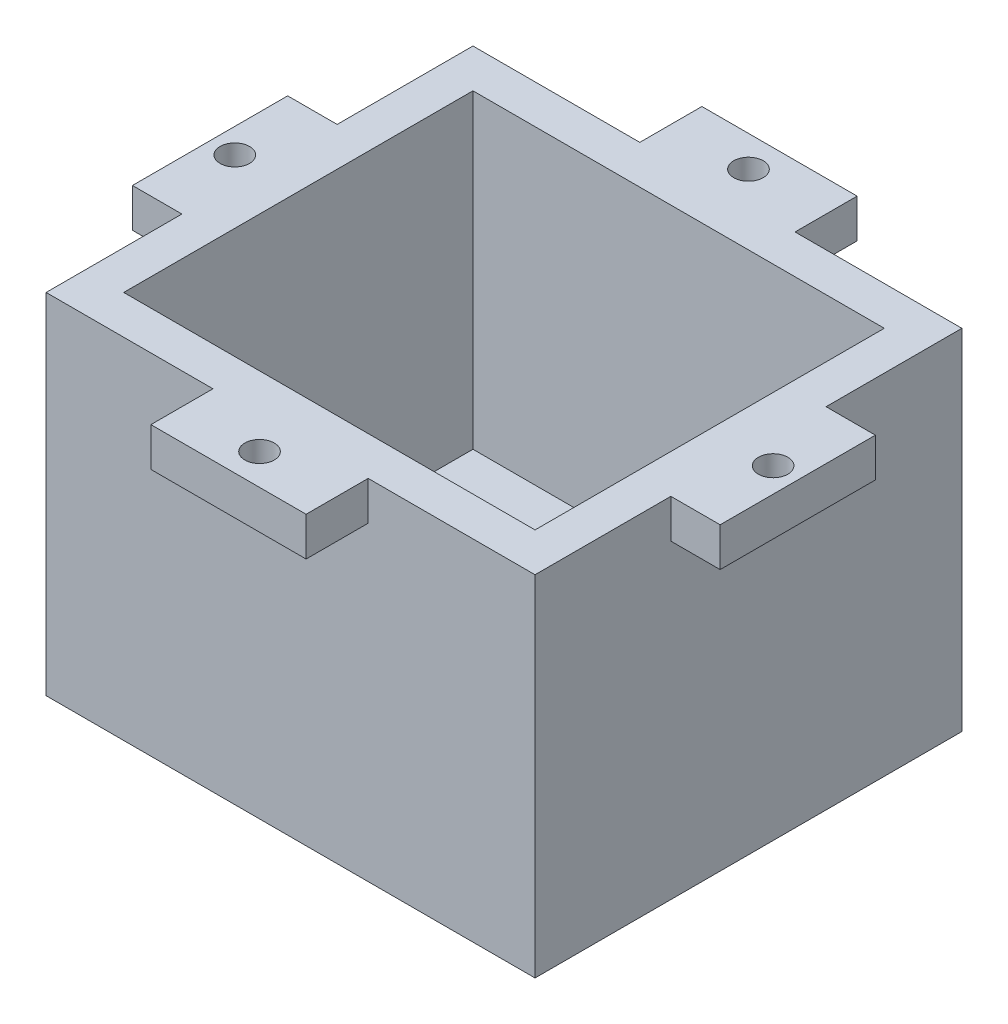
ISO-10303-21;
HEADER;
FILE_DESCRIPTION(('STEP AP214'),'2;1');
FILE_NAME('part.step','',(''),(''),'','','');
FILE_SCHEMA(('AUTOMOTIVE_DESIGN { 1 0 10303 214 1 1 1 1 }'));
ENDSEC;
DATA;
#1=APPLICATION_CONTEXT('core data for automotive mechanical design processes');
#2=APPLICATION_PROTOCOL_DEFINITION('international standard','automotive_design',2000,#1);
#3=PRODUCT_CONTEXT('',#1,'mechanical');
#4=PRODUCT('Part','Part','',(#3));
#5=PRODUCT_RELATED_PRODUCT_CATEGORY('part','',(#4));
#6=PRODUCT_DEFINITION_FORMATION('','',#4);
#7=PRODUCT_DEFINITION_CONTEXT('part definition',#1,'design');
#8=PRODUCT_DEFINITION('design','',#6,#7);
#9=PRODUCT_DEFINITION_SHAPE('','',#8);
#10=(LENGTH_UNIT() NAMED_UNIT(*) SI_UNIT(.MILLI.,.METRE.));
#11=(NAMED_UNIT(*) PLANE_ANGLE_UNIT() SI_UNIT($,.RADIAN.));
#12=(NAMED_UNIT(*) SI_UNIT($,.STERADIAN.) SOLID_ANGLE_UNIT());
#13=UNCERTAINTY_MEASURE_WITH_UNIT(LENGTH_MEASURE(1.E-05),#10,'distance_accuracy_value','');
#14=(GEOMETRIC_REPRESENTATION_CONTEXT(3) GLOBAL_UNCERTAINTY_ASSIGNED_CONTEXT((#13)) GLOBAL_UNIT_ASSIGNED_CONTEXT((#10,
#11,#12)) REPRESENTATION_CONTEXT('',''));
#15=CARTESIAN_POINT('',(0.,0.,0.));
#16=DIRECTION('',(0.,0.,1.));
#17=DIRECTION('',(1.,0.,0.));
#18=AXIS2_PLACEMENT_3D('',#15,#16,#17);
#19=CARTESIAN_POINT('',(20.047158436372,45.,-23.4009350280316));
#20=DIRECTION('',(-1.,0.,0.));
#21=DIRECTION('',(0.,0.,1.));
#22=AXIS2_PLACEMENT_3D('',#19,#20,#21);
#23=PLANE('',#22);
#24=DIRECTION('',(0.,1.,0.));
#25=VECTOR('',#24,1.);
#26=CARTESIAN_POINT('',(20.047158436372,40.,-5.90093502803163));
#27=LINE('',#26,#25);
#28=CARTESIAN_POINT('',(20.047158436372,40.,-5.90093502803163));
#29=VERTEX_POINT('',#28);
#30=CARTESIAN_POINT('',(20.047158436372,45.,-5.90093502803163));
#31=VERTEX_POINT('',#30);
#32=EDGE_CURVE('E218',#29,#31,#27,.T.);
#33=ORIENTED_EDGE('',*,*,#32,.F.);
#34=DIRECTION('',(0.,0.,1.));
#35=VECTOR('',#34,1.);
#36=CARTESIAN_POINT('',(20.047158436372,40.,-5.90093502803163));
#37=LINE('',#36,#35);
#38=CARTESIAN_POINT('',(20.047158436372,40.,14.0990649719684));
#39=VERTEX_POINT('',#38);
#40=EDGE_CURVE('E211',#29,#39,#37,.T.);
#41=ORIENTED_EDGE('',*,*,#40,.T.);
#42=DIRECTION('',(0.,1.,0.));
#43=VECTOR('',#42,1.);
#44=CARTESIAN_POINT('',(20.047158436372,40.,14.0990649719684));
#45=LINE('',#44,#43);
#46=CARTESIAN_POINT('',(20.047158436372,45.,14.0990649719684));
#47=VERTEX_POINT('',#46);
#48=EDGE_CURVE('E196',#39,#47,#45,.T.);
#49=ORIENTED_EDGE('',*,*,#48,.T.);
#50=DIRECTION('',(0.,0.,-1.));
#51=VECTOR('',#50,1.);
#52=CARTESIAN_POINT('',(20.047158436372,45.,-23.4009350280316));
#53=LINE('',#52,#51);
#54=CARTESIAN_POINT('',(20.047158436372,45.,31.5990649719684));
#55=VERTEX_POINT('',#54);
#56=EDGE_CURVE('E363',#55,#47,#53,.T.);
#57=ORIENTED_EDGE('',*,*,#56,.F.);
#58=DIRECTION('',(0.,-1.,0.));
#59=VECTOR('',#58,1.);
#60=CARTESIAN_POINT('',(20.047158436372,45.,31.5990649719684));
#61=LINE('',#60,#59);
#62=CARTESIAN_POINT('',(20.047158436372,0.,31.5990649719684));
#63=VERTEX_POINT('',#62);
#64=EDGE_CURVE('E45',#55,#63,#61,.T.);
#65=ORIENTED_EDGE('',*,*,#64,.T.);
#66=DIRECTION('',(0.,0.,-1.));
#67=VECTOR('',#66,1.);
#68=CARTESIAN_POINT('',(20.047158436372,0.,-23.4009350280316));
#69=LINE('',#68,#67);
#70=CARTESIAN_POINT('',(20.047158436372,0.,-23.4009350280316));
#71=VERTEX_POINT('',#70);
#72=EDGE_CURVE('E374',#63,#71,#69,.T.);
#73=ORIENTED_EDGE('',*,*,#72,.T.);
#74=DIRECTION('',(0.,-1.,0.));
#75=VECTOR('',#74,1.);
#76=CARTESIAN_POINT('',(20.047158436372,45.,-23.4009350280316));
#77=LINE('',#76,#75);
#78=CARTESIAN_POINT('',(20.047158436372,45.,-23.4009350280316));
#79=VERTEX_POINT('',#78);
#80=EDGE_CURVE('E380',#79,#71,#77,.T.);
#81=ORIENTED_EDGE('',*,*,#80,.F.);
#82=EDGE_CURVE('E362',#31,#79,#53,.T.);
#83=ORIENTED_EDGE('',*,*,#82,.F.);
#84=EDGE_LOOP('',(#33,#41,#49,#57,#65,#73,#81,#83));
#85=FACE_BOUND('',#84,.T.);
#86=ADVANCED_FACE('F37',(#85),#23,.F.);
#87=CARTESIAN_POINT('',(-42.952841563628,45.,-23.4009350280316));
#88=DIRECTION('',(1.,0.,0.));
#89=DIRECTION('',(0.,0.,-1.));
#90=AXIS2_PLACEMENT_3D('',#87,#88,#89);
#91=PLANE('',#90);
#92=DIRECTION('',(0.,1.,0.));
#93=VECTOR('',#92,1.);
#94=CARTESIAN_POINT('',(-42.952841563628,40.,14.0990649719684));
#95=LINE('',#94,#93);
#96=CARTESIAN_POINT('',(-42.952841563628,40.,14.0990649719684));
#97=VERTEX_POINT('',#96);
#98=CARTESIAN_POINT('',(-42.952841563628,45.,14.0990649719684));
#99=VERTEX_POINT('',#98);
#100=EDGE_CURVE('E257',#97,#99,#95,.T.);
#101=ORIENTED_EDGE('',*,*,#100,.F.);
#102=DIRECTION('',(0.,0.,-1.));
#103=VECTOR('',#102,1.);
#104=CARTESIAN_POINT('',(-42.952841563628,40.,-5.90093502803163));
#105=LINE('',#104,#103);
#106=CARTESIAN_POINT('',(-42.952841563628,40.,-5.90093502803163));
#107=VERTEX_POINT('',#106);
#108=EDGE_CURVE('E237',#97,#107,#105,.T.);
#109=ORIENTED_EDGE('',*,*,#108,.T.);
#110=DIRECTION('',(0.,1.,0.));
#111=VECTOR('',#110,1.);
#112=CARTESIAN_POINT('',(-42.952841563628,40.,-5.90093502803163));
#113=LINE('',#112,#111);
#114=CARTESIAN_POINT('',(-42.952841563628,45.,-5.90093502803163));
#115=VERTEX_POINT('',#114);
#116=EDGE_CURVE('E250',#107,#115,#113,.T.);
#117=ORIENTED_EDGE('',*,*,#116,.T.);
#118=DIRECTION('',(0.,0.,1.));
#119=VECTOR('',#118,1.);
#120=CARTESIAN_POINT('',(-42.952841563628,45.,-23.4009350280316));
#121=LINE('',#120,#119);
#122=CARTESIAN_POINT('',(-42.952841563628,45.,-23.4009350280316));
#123=VERTEX_POINT('',#122);
#124=EDGE_CURVE('E354',#123,#115,#121,.T.);
#125=ORIENTED_EDGE('',*,*,#124,.F.);
#126=DIRECTION('',(0.,-1.,0.));
#127=VECTOR('',#126,1.);
#128=CARTESIAN_POINT('',(-42.952841563628,45.,-23.4009350280316));
#129=LINE('',#128,#127);
#130=CARTESIAN_POINT('',(-42.952841563628,0.,-23.4009350280316));
#131=VERTEX_POINT('',#130);
#132=EDGE_CURVE('E369',#123,#131,#129,.T.);
#133=ORIENTED_EDGE('',*,*,#132,.T.);
#134=DIRECTION('',(0.,0.,1.));
#135=VECTOR('',#134,1.);
#136=CARTESIAN_POINT('',(-42.952841563628,0.,-23.4009350280316));
#137=LINE('',#136,#135);
#138=CARTESIAN_POINT('',(-42.952841563628,0.,31.5990649719684));
#139=VERTEX_POINT('',#138);
#140=EDGE_CURVE('E330',#131,#139,#137,.T.);
#141=ORIENTED_EDGE('',*,*,#140,.T.);
#142=DIRECTION('',(0.,-1.,0.));
#143=VECTOR('',#142,1.);
#144=CARTESIAN_POINT('',(-42.952841563628,45.,31.5990649719684));
#145=LINE('',#144,#143);
#146=CARTESIAN_POINT('',(-42.952841563628,45.,31.5990649719684));
#147=VERTEX_POINT('',#146);
#148=EDGE_CURVE('E11',#147,#139,#145,.T.);
#149=ORIENTED_EDGE('',*,*,#148,.F.);
#150=EDGE_CURVE('E358',#99,#147,#121,.T.);
#151=ORIENTED_EDGE('',*,*,#150,.F.);
#152=EDGE_LOOP('',(#101,#109,#117,#125,#133,#141,#149,#151));
#153=FACE_BOUND('',#152,.T.);
#154=ADVANCED_FACE('F39',(#153),#91,.F.);
#155=CARTESIAN_POINT('',(-42.952841563628,45.,31.5990649719684));
#156=DIRECTION('',(0.,0.,-1.));
#157=DIRECTION('',(-1.,0.,0.));
#158=AXIS2_PLACEMENT_3D('',#155,#156,#157);
#159=PLANE('',#158);
#160=DIRECTION('',(0.,1.,0.));
#161=VECTOR('',#160,1.);
#162=CARTESIAN_POINT('',(-1.45284156362801,40.,31.5990649719684));
#163=LINE('',#162,#161);
#164=CARTESIAN_POINT('',(-1.45284156362801,40.,31.5990649719684));
#165=VERTEX_POINT('',#164);
#166=CARTESIAN_POINT('',(-1.45284156362801,45.,31.5990649719684));
#167=VERTEX_POINT('',#166);
#168=EDGE_CURVE('E289',#165,#167,#163,.T.);
#169=ORIENTED_EDGE('',*,*,#168,.F.);
#170=DIRECTION('',(-1.,0.,0.));
#171=VECTOR('',#170,1.);
#172=CARTESIAN_POINT('',(-21.452841563628,40.,31.5990649719684));
#173=LINE('',#172,#171);
#174=CARTESIAN_POINT('',(-21.452841563628,40.,31.5990649719684));
#175=VERTEX_POINT('',#174);
#176=EDGE_CURVE('E274',#165,#175,#173,.T.);
#177=ORIENTED_EDGE('',*,*,#176,.T.);
#178=DIRECTION('',(0.,1.,0.));
#179=VECTOR('',#178,1.);
#180=CARTESIAN_POINT('',(-21.452841563628,40.,31.5990649719684));
#181=LINE('',#180,#179);
#182=CARTESIAN_POINT('',(-21.452841563628,45.,31.5990649719684));
#183=VERTEX_POINT('',#182);
#184=EDGE_CURVE('E285',#175,#183,#181,.T.);
#185=ORIENTED_EDGE('',*,*,#184,.T.);
#186=DIRECTION('',(1.,0.,0.));
#187=VECTOR('',#186,1.);
#188=CARTESIAN_POINT('',(-42.952841563628,45.,31.5990649719684));
#189=LINE('',#188,#187);
#190=EDGE_CURVE('E359',#147,#183,#189,.T.);
#191=ORIENTED_EDGE('',*,*,#190,.F.);
#192=ORIENTED_EDGE('',*,*,#148,.T.);
#193=DIRECTION('',(1.,0.,0.));
#194=VECTOR('',#193,1.);
#195=CARTESIAN_POINT('',(-42.952841563628,0.,31.5990649719684));
#196=LINE('',#195,#194);
#197=EDGE_CURVE('E372',#139,#63,#196,.T.);
#198=ORIENTED_EDGE('',*,*,#197,.T.);
#199=ORIENTED_EDGE('',*,*,#64,.F.);
#200=EDGE_CURVE('E357',#167,#55,#189,.T.);
#201=ORIENTED_EDGE('',*,*,#200,.F.);
#202=EDGE_LOOP('',(#169,#177,#185,#191,#192,#198,#199,#201));
#203=FACE_BOUND('',#202,.T.);
#204=ADVANCED_FACE('F425',(#203),#159,.F.);
#205=CARTESIAN_POINT('',(-42.952841563628,45.,-23.4009350280316));
#206=DIRECTION('',(0.,0.,1.));
#207=DIRECTION('',(1.,0.,0.));
#208=AXIS2_PLACEMENT_3D('',#205,#206,#207);
#209=PLANE('',#208);
#210=DIRECTION('',(0.,1.,0.));
#211=VECTOR('',#210,1.);
#212=CARTESIAN_POINT('',(-21.452841563628,40.,-23.4009350280316));
#213=LINE('',#212,#211);
#214=CARTESIAN_POINT('',(-21.452841563628,40.,-23.4009350280316));
#215=VERTEX_POINT('',#214);
#216=CARTESIAN_POINT('',(-21.452841563628,45.,-23.4009350280316));
#217=VERTEX_POINT('',#216);
#218=EDGE_CURVE('E307',#215,#217,#213,.T.);
#219=ORIENTED_EDGE('',*,*,#218,.F.);
#220=DIRECTION('',(1.,0.,0.));
#221=VECTOR('',#220,1.);
#222=CARTESIAN_POINT('',(-21.452841563628,40.,-23.4009350280316));
#223=LINE('',#222,#221);
#224=CARTESIAN_POINT('',(-1.45284156362801,40.,-23.4009350280316));
#225=VERTEX_POINT('',#224);
#226=EDGE_CURVE('E297',#215,#225,#223,.T.);
#227=ORIENTED_EDGE('',*,*,#226,.T.);
#228=DIRECTION('',(0.,1.,0.));
#229=VECTOR('',#228,1.);
#230=CARTESIAN_POINT('',(-1.45284156362801,40.,-23.4009350280316));
#231=LINE('',#230,#229);
#232=CARTESIAN_POINT('',(-1.45284156362801,45.,-23.4009350280316));
#233=VERTEX_POINT('',#232);
#234=EDGE_CURVE('E320',#225,#233,#231,.T.);
#235=ORIENTED_EDGE('',*,*,#234,.T.);
#236=DIRECTION('',(-1.,0.,0.));
#237=VECTOR('',#236,1.);
#238=CARTESIAN_POINT('',(-42.952841563628,45.,-23.4009350280316));
#239=LINE('',#238,#237);
#240=EDGE_CURVE('E366',#79,#233,#239,.T.);
#241=ORIENTED_EDGE('',*,*,#240,.F.);
#242=ORIENTED_EDGE('',*,*,#80,.T.);
#243=DIRECTION('',(-1.,0.,0.));
#244=VECTOR('',#243,1.);
#245=CARTESIAN_POINT('',(-42.952841563628,0.,-23.4009350280316));
#246=LINE('',#245,#244);
#247=EDGE_CURVE('E376',#71,#131,#246,.T.);
#248=ORIENTED_EDGE('',*,*,#247,.T.);
#249=ORIENTED_EDGE('',*,*,#132,.F.);
#250=EDGE_CURVE('E365',#217,#123,#239,.T.);
#251=ORIENTED_EDGE('',*,*,#250,.F.);
#252=EDGE_LOOP('',(#219,#227,#235,#241,#242,#248,#249,#251));
#253=FACE_BOUND('',#252,.T.);
#254=ADVANCED_FACE('F395',(#253),#209,.F.);
#255=CARTESIAN_POINT('',(0.,45.,0.));
#256=DIRECTION('',(0.,1.,0.));
#257=DIRECTION('',(0.,0.,1.));
#258=AXIS2_PLACEMENT_3D('',#255,#256,#257);
#259=PLANE('',#258);
#260=CARTESIAN_POINT('',(-11.452841563628,45.,35.5990649719684));
#261=DIRECTION('',(0.,-1.,0.));
#262=DIRECTION('',(0.,0.,-1.));
#263=AXIS2_PLACEMENT_3D('',#260,#261,#262);
#264=CIRCLE('',#263,1.89865);
#265=CARTESIAN_POINT('',(-11.452841563628,45.,33.7004149719684));
#266=VERTEX_POINT('',#265);
#267=EDGE_CURVE('E526',#266,#266,#264,.T.);
#268=ORIENTED_EDGE('',*,*,#267,.T.);
#269=EDGE_LOOP('',(#268));
#270=FACE_BOUND('',#269,.T.);
#271=CARTESIAN_POINT('',(-11.452841563628,45.,-27.4009350280316));
#272=DIRECTION('',(0.,-1.,0.));
#273=DIRECTION('',(0.,0.,-1.));
#274=AXIS2_PLACEMENT_3D('',#271,#272,#273);
#275=CIRCLE('',#274,1.89865);
#276=CARTESIAN_POINT('',(-11.452841563628,45.,-29.2995850280316));
#277=VERTEX_POINT('',#276);
#278=EDGE_CURVE('E533',#277,#277,#275,.T.);
#279=ORIENTED_EDGE('',*,*,#278,.T.);
#280=EDGE_LOOP('',(#279));
#281=FACE_BOUND('',#280,.T.);
#282=CARTESIAN_POINT('',(-46.140541563628,45.,4.09906497196836));
#283=DIRECTION('',(0.,-1.,0.));
#284=DIRECTION('',(0.,0.,-1.));
#285=AXIS2_PLACEMENT_3D('',#282,#283,#284);
#286=CIRCLE('',#285,1.89865);
#287=CARTESIAN_POINT('',(-46.140541563628,45.,2.20041497196836));
#288=VERTEX_POINT('',#287);
#289=EDGE_CURVE('E539',#288,#288,#286,.T.);
#290=ORIENTED_EDGE('',*,*,#289,.T.);
#291=EDGE_LOOP('',(#290));
#292=FACE_BOUND('',#291,.T.);
#293=CARTESIAN_POINT('',(23.222158436372,45.,4.09906497196836));
#294=DIRECTION('',(0.,-1.,0.));
#295=DIRECTION('',(0.,0.,-1.));
#296=AXIS2_PLACEMENT_3D('',#293,#294,#295);
#297=CIRCLE('',#296,1.89865);
#298=CARTESIAN_POINT('',(23.222158436372,45.,2.20041497196836));
#299=VERTEX_POINT('',#298);
#300=EDGE_CURVE('E225',#299,#299,#297,.T.);
#301=ORIENTED_EDGE('',*,*,#300,.T.);
#302=EDGE_LOOP('',(#301));
#303=FACE_BOUND('',#302,.T.);
#304=DIRECTION('',(0.,0.,1.));
#305=VECTOR('',#304,1.);
#306=CARTESIAN_POINT('',(-37.952841563628,45.,-23.4009350280316));
#307=LINE('',#306,#305);
#308=CARTESIAN_POINT('',(-37.952841563628,45.,-18.4009350280316));
#309=VERTEX_POINT('',#308);
#310=CARTESIAN_POINT('',(-37.952841563628,45.,26.5990649719684));
#311=VERTEX_POINT('',#310);
#312=EDGE_CURVE('E346',#309,#311,#307,.T.);
#313=ORIENTED_EDGE('',*,*,#312,.F.);
#314=DIRECTION('',(-1.,0.,0.));
#315=VECTOR('',#314,1.);
#316=CARTESIAN_POINT('',(-42.952841563628,45.,-18.4009350280316));
#317=LINE('',#316,#315);
#318=CARTESIAN_POINT('',(15.047158436372,45.,-18.4009350280316));
#319=VERTEX_POINT('',#318);
#320=EDGE_CURVE('E336',#319,#309,#317,.T.);
#321=ORIENTED_EDGE('',*,*,#320,.F.);
#322=DIRECTION('',(0.,0.,-1.));
#323=VECTOR('',#322,1.);
#324=CARTESIAN_POINT('',(15.047158436372,45.,-23.4009350280316));
#325=LINE('',#324,#323);
#326=CARTESIAN_POINT('',(15.047158436372,45.,26.5990649719684));
#327=VERTEX_POINT('',#326);
#328=EDGE_CURVE('E350',#327,#319,#325,.T.);
#329=ORIENTED_EDGE('',*,*,#328,.F.);
#330=DIRECTION('',(1.,0.,0.));
#331=VECTOR('',#330,1.);
#332=CARTESIAN_POINT('',(-42.952841563628,45.,26.5990649719684));
#333=LINE('',#332,#331);
#334=EDGE_CURVE('E348',#311,#327,#333,.T.);
#335=ORIENTED_EDGE('',*,*,#334,.F.);
#336=EDGE_LOOP('',(#313,#321,#329,#335));
#337=FACE_BOUND('',#336,.T.);
#338=ORIENTED_EDGE('',*,*,#124,.T.);
#339=DIRECTION('',(-1.,0.,0.));
#340=VECTOR('',#339,1.);
#341=CARTESIAN_POINT('',(-42.952841563628,45.,-5.90093502803163));
#342=LINE('',#341,#340);
#343=CARTESIAN_POINT('',(-49.328241563628,45.,-5.90093502803164));
#344=VERTEX_POINT('',#343);
#345=EDGE_CURVE('E60',#115,#344,#342,.T.);
#346=ORIENTED_EDGE('',*,*,#345,.T.);
#347=DIRECTION('',(0.,0.,1.));
#348=VECTOR('',#347,1.);
#349=CARTESIAN_POINT('',(-49.328241563628,45.,-5.90093502803164));
#350=LINE('',#349,#348);
#351=CARTESIAN_POINT('',(-49.328241563628,45.,14.0990649719684));
#352=VERTEX_POINT('',#351);
#353=EDGE_CURVE('E252',#344,#352,#350,.T.);
#354=ORIENTED_EDGE('',*,*,#353,.T.);
#355=DIRECTION('',(1.,0.,0.));
#356=VECTOR('',#355,1.);
#357=CARTESIAN_POINT('',(-42.952841563628,45.,14.0990649719684));
#358=LINE('',#357,#356);
#359=EDGE_CURVE('E241',#352,#99,#358,.T.);
#360=ORIENTED_EDGE('',*,*,#359,.T.);
#361=ORIENTED_EDGE('',*,*,#150,.T.);
#362=ORIENTED_EDGE('',*,*,#190,.T.);
#363=DIRECTION('',(0.,0.,1.));
#364=VECTOR('',#363,1.);
#365=CARTESIAN_POINT('',(-21.452841563628,45.,31.5990649719684));
#366=LINE('',#365,#364);
#367=CARTESIAN_POINT('',(-21.452841563628,45.,39.5990649719684));
#368=VERTEX_POINT('',#367);
#369=EDGE_CURVE('E259',#183,#368,#366,.T.);
#370=ORIENTED_EDGE('',*,*,#369,.T.);
#371=DIRECTION('',(1.,0.,0.));
#372=VECTOR('',#371,1.);
#373=CARTESIAN_POINT('',(-21.452841563628,45.,39.5990649719684));
#374=LINE('',#373,#372);
#375=CARTESIAN_POINT('',(-1.45284156362801,45.,39.5990649719684));
#376=VERTEX_POINT('',#375);
#377=EDGE_CURVE('E280',#368,#376,#374,.T.);
#378=ORIENTED_EDGE('',*,*,#377,.T.);
#379=DIRECTION('',(0.,0.,-1.));
#380=VECTOR('',#379,1.);
#381=CARTESIAN_POINT('',(-1.45284156362801,45.,31.5990649719684));
#382=LINE('',#381,#380);
#383=EDGE_CURVE('E269',#376,#167,#382,.T.);
#384=ORIENTED_EDGE('',*,*,#383,.T.);
#385=ORIENTED_EDGE('',*,*,#200,.T.);
#386=ORIENTED_EDGE('',*,*,#56,.T.);
#387=DIRECTION('',(1.,0.,0.));
#388=VECTOR('',#387,1.);
#389=CARTESIAN_POINT('',(20.047158436372,45.,14.0990649719684));
#390=LINE('',#389,#388);
#391=CARTESIAN_POINT('',(26.397158436372,45.,14.0990649719684));
#392=VERTEX_POINT('',#391);
#393=EDGE_CURVE('E52',#47,#392,#390,.T.);
#394=ORIENTED_EDGE('',*,*,#393,.T.);
#395=DIRECTION('',(0.,0.,-1.));
#396=VECTOR('',#395,1.);
#397=CARTESIAN_POINT('',(26.397158436372,45.,-5.90093502803163));
#398=LINE('',#397,#396);
#399=CARTESIAN_POINT('',(26.397158436372,45.,-5.90093502803163));
#400=VERTEX_POINT('',#399);
#401=EDGE_CURVE('E222',#392,#400,#398,.T.);
#402=ORIENTED_EDGE('',*,*,#401,.T.);
#403=DIRECTION('',(-1.,0.,0.));
#404=VECTOR('',#403,1.);
#405=CARTESIAN_POINT('',(20.047158436372,45.,-5.90093502803163));
#406=LINE('',#405,#404);
#407=EDGE_CURVE('E219',#400,#31,#406,.T.);
#408=ORIENTED_EDGE('',*,*,#407,.T.);
#409=ORIENTED_EDGE('',*,*,#82,.T.);
#410=ORIENTED_EDGE('',*,*,#240,.T.);
#411=DIRECTION('',(0.,0.,-1.));
#412=VECTOR('',#411,1.);
#413=CARTESIAN_POINT('',(-1.45284156362801,45.,-31.4009350280316));
#414=LINE('',#413,#412);
#415=CARTESIAN_POINT('',(-1.45284156362801,45.,-31.4009350280316));
#416=VERTEX_POINT('',#415);
#417=EDGE_CURVE('E310',#233,#416,#414,.T.);
#418=ORIENTED_EDGE('',*,*,#417,.T.);
#419=DIRECTION('',(-1.,0.,0.));
#420=VECTOR('',#419,1.);
#421=CARTESIAN_POINT('',(-21.452841563628,45.,-31.4009350280316));
#422=LINE('',#421,#420);
#423=CARTESIAN_POINT('',(-21.452841563628,45.,-31.4009350280316));
#424=VERTEX_POINT('',#423);
#425=EDGE_CURVE('E298',#416,#424,#422,.T.);
#426=ORIENTED_EDGE('',*,*,#425,.T.);
#427=DIRECTION('',(0.,0.,1.));
#428=VECTOR('',#427,1.);
#429=CARTESIAN_POINT('',(-21.452841563628,45.,-31.4009350280316));
#430=LINE('',#429,#428);
#431=EDGE_CURVE('E288',#424,#217,#430,.T.);
#432=ORIENTED_EDGE('',*,*,#431,.T.);
#433=ORIENTED_EDGE('',*,*,#250,.T.);
#434=EDGE_LOOP('',(#338,#346,#354,#360,#361,#362,#370,#378,#384,#385,#386,#394,#402,#408,#409,
#410,#418,#426,#432,#433));
#435=FACE_BOUND('',#434,.T.);
#436=ADVANCED_FACE('F403',(#270,#281,#292,#303,#337,#435),#259,.T.);
#437=CARTESIAN_POINT('',(0.,0.,0.));
#438=DIRECTION('',(0.,1.,0.));
#439=DIRECTION('',(0.,0.,1.));
#440=AXIS2_PLACEMENT_3D('',#437,#438,#439);
#441=PLANE('',#440);
#442=ORIENTED_EDGE('',*,*,#140,.F.);
#443=ORIENTED_EDGE('',*,*,#247,.F.);
#444=ORIENTED_EDGE('',*,*,#72,.F.);
#445=ORIENTED_EDGE('',*,*,#197,.F.);
#446=EDGE_LOOP('',(#442,#443,#444,#445));
#447=FACE_BOUND('',#446,.T.);
#448=ADVANCED_FACE('F391',(#447),#441,.F.);
#449=CARTESIAN_POINT('',(-37.952841563628,45.,-23.4009350280316));
#450=DIRECTION('',(1.,0.,0.));
#451=DIRECTION('',(0.,0.,-1.));
#452=AXIS2_PLACEMENT_3D('',#449,#450,#451);
#453=PLANE('',#452);
#454=DIRECTION('',(0.,0.,1.));
#455=VECTOR('',#454,1.);
#456=CARTESIAN_POINT('',(-37.952841563628,5.,-23.4009350280316));
#457=LINE('',#456,#455);
#458=CARTESIAN_POINT('',(-37.952841563628,5.,-18.4009350280316));
#459=VERTEX_POINT('',#458);
#460=CARTESIAN_POINT('',(-37.952841563628,5.,26.5990649719684));
#461=VERTEX_POINT('',#460);
#462=EDGE_CURVE('E317',#459,#461,#457,.T.);
#463=ORIENTED_EDGE('',*,*,#462,.F.);
#464=DIRECTION('',(0.,-1.,0.));
#465=VECTOR('',#464,1.);
#466=CARTESIAN_POINT('',(-37.952841563628,45.,-18.4009350280316));
#467=LINE('',#466,#465);
#468=EDGE_CURVE('E332',#309,#459,#467,.T.);
#469=ORIENTED_EDGE('',*,*,#468,.F.);
#470=ORIENTED_EDGE('',*,*,#312,.T.);
#471=DIRECTION('',(0.,-1.,0.));
#472=VECTOR('',#471,1.);
#473=CARTESIAN_POINT('',(-37.952841563628,45.,26.5990649719684));
#474=LINE('',#473,#472);
#475=EDGE_CURVE('E327',#311,#461,#474,.T.);
#476=ORIENTED_EDGE('',*,*,#475,.T.);
#477=EDGE_LOOP('',(#463,#469,#470,#476));
#478=FACE_BOUND('',#477,.T.);
#479=ADVANCED_FACE('F478',(#478),#453,.T.);
#480=CARTESIAN_POINT('',(-42.952841563628,45.,26.5990649719684));
#481=DIRECTION('',(0.,0.,-1.));
#482=DIRECTION('',(-1.,0.,0.));
#483=AXIS2_PLACEMENT_3D('',#480,#481,#482);
#484=PLANE('',#483);
#485=DIRECTION('',(1.,0.,0.));
#486=VECTOR('',#485,1.);
#487=CARTESIAN_POINT('',(-42.952841563628,5.,26.5990649719684));
#488=LINE('',#487,#486);
#489=CARTESIAN_POINT('',(15.047158436372,5.,26.5990649719684));
#490=VERTEX_POINT('',#489);
#491=EDGE_CURVE('E326',#461,#490,#488,.T.);
#492=ORIENTED_EDGE('',*,*,#491,.F.);
#493=ORIENTED_EDGE('',*,*,#475,.F.);
#494=ORIENTED_EDGE('',*,*,#334,.T.);
#495=DIRECTION('',(0.,-1.,0.));
#496=VECTOR('',#495,1.);
#497=CARTESIAN_POINT('',(15.047158436372,45.,26.5990649719684));
#498=LINE('',#497,#496);
#499=EDGE_CURVE('E331',#327,#490,#498,.T.);
#500=ORIENTED_EDGE('',*,*,#499,.T.);
#501=EDGE_LOOP('',(#492,#493,#494,#500));
#502=FACE_BOUND('',#501,.T.);
#503=ADVANCED_FACE('F493',(#502),#484,.T.);
#504=CARTESIAN_POINT('',(15.047158436372,45.,-23.4009350280316));
#505=DIRECTION('',(-1.,0.,0.));
#506=DIRECTION('',(0.,0.,1.));
#507=AXIS2_PLACEMENT_3D('',#504,#505,#506);
#508=PLANE('',#507);
#509=DIRECTION('',(0.,0.,-1.));
#510=VECTOR('',#509,1.);
#511=CARTESIAN_POINT('',(15.047158436372,5.,-23.4009350280316));
#512=LINE('',#511,#510);
#513=CARTESIAN_POINT('',(15.047158436372,5.,-18.4009350280316));
#514=VERTEX_POINT('',#513);
#515=EDGE_CURVE('E338',#490,#514,#512,.T.);
#516=ORIENTED_EDGE('',*,*,#515,.F.);
#517=ORIENTED_EDGE('',*,*,#499,.F.);
#518=ORIENTED_EDGE('',*,*,#328,.T.);
#519=DIRECTION('',(0.,-1.,0.));
#520=VECTOR('',#519,1.);
#521=CARTESIAN_POINT('',(15.047158436372,45.,-18.4009350280316));
#522=LINE('',#521,#520);
#523=EDGE_CURVE('E335',#319,#514,#522,.T.);
#524=ORIENTED_EDGE('',*,*,#523,.T.);
#525=EDGE_LOOP('',(#516,#517,#518,#524));
#526=FACE_BOUND('',#525,.T.);
#527=ADVANCED_FACE('F489',(#526),#508,.T.);
#528=CARTESIAN_POINT('',(-42.952841563628,45.,-18.4009350280316));
#529=DIRECTION('',(0.,0.,1.));
#530=DIRECTION('',(1.,0.,0.));
#531=AXIS2_PLACEMENT_3D('',#528,#529,#530);
#532=PLANE('',#531);
#533=DIRECTION('',(-1.,0.,0.));
#534=VECTOR('',#533,1.);
#535=CARTESIAN_POINT('',(-42.952841563628,5.,-18.4009350280316));
#536=LINE('',#535,#534);
#537=EDGE_CURVE('E342',#514,#459,#536,.T.);
#538=ORIENTED_EDGE('',*,*,#537,.F.);
#539=ORIENTED_EDGE('',*,*,#523,.F.);
#540=ORIENTED_EDGE('',*,*,#320,.T.);
#541=ORIENTED_EDGE('',*,*,#468,.T.);
#542=EDGE_LOOP('',(#538,#539,#540,#541));
#543=FACE_BOUND('',#542,.T.);
#544=ADVANCED_FACE('F485',(#543),#532,.T.);
#545=CARTESIAN_POINT('',(0.,5.,0.));
#546=DIRECTION('',(0.,1.,0.));
#547=DIRECTION('',(0.,0.,1.));
#548=AXIS2_PLACEMENT_3D('',#545,#546,#547);
#549=PLANE('',#548);
#550=ORIENTED_EDGE('',*,*,#462,.T.);
#551=ORIENTED_EDGE('',*,*,#491,.T.);
#552=ORIENTED_EDGE('',*,*,#515,.T.);
#553=ORIENTED_EDGE('',*,*,#537,.T.);
#554=EDGE_LOOP('',(#550,#551,#552,#553));
#555=FACE_BOUND('',#554,.T.);
#556=ADVANCED_FACE('F482',(#555),#549,.T.);
#557=CARTESIAN_POINT('',(-21.452841563628,40.,-31.4009350280316));
#558=DIRECTION('',(-1.,0.,0.));
#559=DIRECTION('',(0.,0.,1.));
#560=AXIS2_PLACEMENT_3D('',#557,#558,#559);
#561=PLANE('',#560);
#562=ORIENTED_EDGE('',*,*,#431,.F.);
#563=DIRECTION('',(0.,1.,0.));
#564=VECTOR('',#563,1.);
#565=CARTESIAN_POINT('',(-21.452841563628,40.,-31.4009350280316));
#566=LINE('',#565,#564);
#567=CARTESIAN_POINT('',(-21.452841563628,40.,-31.4009350280316));
#568=VERTEX_POINT('',#567);
#569=EDGE_CURVE('E315',#568,#424,#566,.T.);
#570=ORIENTED_EDGE('',*,*,#569,.F.);
#571=DIRECTION('',(0.,0.,1.));
#572=VECTOR('',#571,1.);
#573=CARTESIAN_POINT('',(-21.452841563628,40.,-31.4009350280316));
#574=LINE('',#573,#572);
#575=EDGE_CURVE('E294',#568,#215,#574,.T.);
#576=ORIENTED_EDGE('',*,*,#575,.T.);
#577=ORIENTED_EDGE('',*,*,#218,.T.);
#578=EDGE_LOOP('',(#562,#570,#576,#577));
#579=FACE_BOUND('',#578,.T.);
#580=ADVANCED_FACE('F406',(#579),#561,.T.);
#581=CARTESIAN_POINT('',(-21.452841563628,40.,-31.4009350280316));
#582=DIRECTION('',(0.,0.,-1.));
#583=DIRECTION('',(-1.,0.,0.));
#584=AXIS2_PLACEMENT_3D('',#581,#582,#583);
#585=PLANE('',#584);
#586=ORIENTED_EDGE('',*,*,#425,.F.);
#587=DIRECTION('',(0.,1.,0.));
#588=VECTOR('',#587,1.);
#589=CARTESIAN_POINT('',(-1.45284156362801,40.,-31.4009350280316));
#590=LINE('',#589,#588);
#591=CARTESIAN_POINT('',(-1.45284156362801,40.,-31.4009350280316));
#592=VERTEX_POINT('',#591);
#593=EDGE_CURVE('E318',#592,#416,#590,.T.);
#594=ORIENTED_EDGE('',*,*,#593,.F.);
#595=DIRECTION('',(-1.,0.,0.));
#596=VECTOR('',#595,1.);
#597=CARTESIAN_POINT('',(-21.452841563628,40.,-31.4009350280316));
#598=LINE('',#597,#596);
#599=EDGE_CURVE('E304',#592,#568,#598,.T.);
#600=ORIENTED_EDGE('',*,*,#599,.T.);
#601=ORIENTED_EDGE('',*,*,#569,.T.);
#602=EDGE_LOOP('',(#586,#594,#600,#601));
#603=FACE_BOUND('',#602,.T.);
#604=ADVANCED_FACE('F414',(#603),#585,.T.);
#605=CARTESIAN_POINT('',(-1.45284156362801,40.,-31.4009350280316));
#606=DIRECTION('',(1.,0.,0.));
#607=DIRECTION('',(0.,0.,-1.));
#608=AXIS2_PLACEMENT_3D('',#605,#606,#607);
#609=PLANE('',#608);
#610=ORIENTED_EDGE('',*,*,#417,.F.);
#611=ORIENTED_EDGE('',*,*,#234,.F.);
#612=DIRECTION('',(0.,0.,-1.));
#613=VECTOR('',#612,1.);
#614=CARTESIAN_POINT('',(-1.45284156362801,40.,-31.4009350280316));
#615=LINE('',#614,#613);
#616=EDGE_CURVE('E301',#225,#592,#615,.T.);
#617=ORIENTED_EDGE('',*,*,#616,.T.);
#618=ORIENTED_EDGE('',*,*,#593,.T.);
#619=EDGE_LOOP('',(#610,#611,#617,#618));
#620=FACE_BOUND('',#619,.T.);
#621=ADVANCED_FACE('F416',(#620),#609,.T.);
#622=CARTESIAN_POINT('',(0.,40.,0.));
#623=DIRECTION('',(0.,1.,0.));
#624=DIRECTION('',(0.,0.,1.));
#625=AXIS2_PLACEMENT_3D('',#622,#623,#624);
#626=PLANE('',#625);
#627=CARTESIAN_POINT('',(-11.452841563628,40.,-27.4009350280316));
#628=DIRECTION('',(0.,-1.,0.));
#629=DIRECTION('',(0.,0.,-1.));
#630=AXIS2_PLACEMENT_3D('',#627,#628,#629);
#631=CIRCLE('',#630,1.89865);
#632=CARTESIAN_POINT('',(-11.452841563628,40.,-29.2995850280317));
#633=VERTEX_POINT('',#632);
#634=EDGE_CURVE('E528',#633,#633,#631,.T.);
#635=ORIENTED_EDGE('',*,*,#634,.F.);
#636=EDGE_LOOP('',(#635));
#637=FACE_BOUND('',#636,.T.);
#638=ORIENTED_EDGE('',*,*,#575,.F.);
#639=ORIENTED_EDGE('',*,*,#599,.F.);
#640=ORIENTED_EDGE('',*,*,#616,.F.);
#641=ORIENTED_EDGE('',*,*,#226,.F.);
#642=EDGE_LOOP('',(#638,#639,#640,#641));
#643=FACE_BOUND('',#642,.T.);
#644=ADVANCED_FACE('F410',(#637,#643),#626,.F.);
#645=CARTESIAN_POINT('',(-21.452841563628,40.,31.5990649719684));
#646=DIRECTION('',(-1.,0.,0.));
#647=DIRECTION('',(0.,0.,1.));
#648=AXIS2_PLACEMENT_3D('',#645,#646,#647);
#649=PLANE('',#648);
#650=ORIENTED_EDGE('',*,*,#369,.F.);
#651=ORIENTED_EDGE('',*,*,#184,.F.);
#652=DIRECTION('',(0.,0.,1.));
#653=VECTOR('',#652,1.);
#654=CARTESIAN_POINT('',(-21.452841563628,40.,31.5990649719684));
#655=LINE('',#654,#653);
#656=CARTESIAN_POINT('',(-21.452841563628,40.,39.5990649719684));
#657=VERTEX_POINT('',#656);
#658=EDGE_CURVE('E265',#175,#657,#655,.T.);
#659=ORIENTED_EDGE('',*,*,#658,.T.);
#660=DIRECTION('',(0.,1.,0.));
#661=VECTOR('',#660,1.);
#662=CARTESIAN_POINT('',(-21.452841563628,40.,39.5990649719684));
#663=LINE('',#662,#661);
#664=EDGE_CURVE('E277',#657,#368,#663,.T.);
#665=ORIENTED_EDGE('',*,*,#664,.T.);
#666=EDGE_LOOP('',(#650,#651,#659,#665));
#667=FACE_BOUND('',#666,.T.);
#668=ADVANCED_FACE('F435',(#667),#649,.T.);
#669=CARTESIAN_POINT('',(-1.45284156362801,40.,31.5990649719684));
#670=DIRECTION('',(1.,0.,0.));
#671=DIRECTION('',(0.,0.,-1.));
#672=AXIS2_PLACEMENT_3D('',#669,#670,#671);
#673=PLANE('',#672);
#674=ORIENTED_EDGE('',*,*,#383,.F.);
#675=DIRECTION('',(0.,1.,0.));
#676=VECTOR('',#675,1.);
#677=CARTESIAN_POINT('',(-1.45284156362801,40.,39.5990649719684));
#678=LINE('',#677,#676);
#679=CARTESIAN_POINT('',(-1.45284156362801,40.,39.5990649719684));
#680=VERTEX_POINT('',#679);
#681=EDGE_CURVE('E291',#680,#376,#678,.T.);
#682=ORIENTED_EDGE('',*,*,#681,.F.);
#683=DIRECTION('',(0.,0.,-1.));
#684=VECTOR('',#683,1.);
#685=CARTESIAN_POINT('',(-1.45284156362801,40.,31.5990649719684));
#686=LINE('',#685,#684);
#687=EDGE_CURVE('E272',#680,#165,#686,.T.);
#688=ORIENTED_EDGE('',*,*,#687,.T.);
#689=ORIENTED_EDGE('',*,*,#168,.T.);
#690=EDGE_LOOP('',(#674,#682,#688,#689));
#691=FACE_BOUND('',#690,.T.);
#692=ADVANCED_FACE('F428',(#691),#673,.T.);
#693=CARTESIAN_POINT('',(-21.452841563628,40.,39.5990649719684));
#694=DIRECTION('',(0.,0.,1.));
#695=DIRECTION('',(1.,0.,0.));
#696=AXIS2_PLACEMENT_3D('',#693,#694,#695);
#697=PLANE('',#696);
#698=ORIENTED_EDGE('',*,*,#377,.F.);
#699=ORIENTED_EDGE('',*,*,#664,.F.);
#700=DIRECTION('',(1.,0.,0.));
#701=VECTOR('',#700,1.);
#702=CARTESIAN_POINT('',(-21.452841563628,40.,39.5990649719684));
#703=LINE('',#702,#701);
#704=EDGE_CURVE('E268',#657,#680,#703,.T.);
#705=ORIENTED_EDGE('',*,*,#704,.T.);
#706=ORIENTED_EDGE('',*,*,#681,.T.);
#707=EDGE_LOOP('',(#698,#699,#705,#706));
#708=FACE_BOUND('',#707,.T.);
#709=ADVANCED_FACE('F512',(#708),#697,.T.);
#710=CARTESIAN_POINT('',(0.,40.,0.));
#711=DIRECTION('',(0.,1.,0.));
#712=DIRECTION('',(0.,0.,1.));
#713=AXIS2_PLACEMENT_3D('',#710,#711,#712);
#714=PLANE('',#713);
#715=CARTESIAN_POINT('',(-11.452841563628,40.,35.5990649719684));
#716=DIRECTION('',(0.,-1.,0.));
#717=DIRECTION('',(0.,0.,-1.));
#718=AXIS2_PLACEMENT_3D('',#715,#716,#717);
#719=CIRCLE('',#718,1.89865);
#720=CARTESIAN_POINT('',(-11.452841563628,40.,33.7004149719684));
#721=VERTEX_POINT('',#720);
#722=EDGE_CURVE('E524',#721,#721,#719,.T.);
#723=ORIENTED_EDGE('',*,*,#722,.F.);
#724=EDGE_LOOP('',(#723));
#725=FACE_BOUND('',#724,.T.);
#726=ORIENTED_EDGE('',*,*,#658,.F.);
#727=ORIENTED_EDGE('',*,*,#176,.F.);
#728=ORIENTED_EDGE('',*,*,#687,.F.);
#729=ORIENTED_EDGE('',*,*,#704,.F.);
#730=EDGE_LOOP('',(#726,#727,#728,#729));
#731=FACE_BOUND('',#730,.T.);
#732=ADVANCED_FACE('F433',(#725,#731),#714,.F.);
#733=CARTESIAN_POINT('',(-42.952841563628,40.,14.0990649719684));
#734=DIRECTION('',(0.,0.,1.));
#735=DIRECTION('',(1.,0.,0.));
#736=AXIS2_PLACEMENT_3D('',#733,#734,#735);
#737=PLANE('',#736);
#738=ORIENTED_EDGE('',*,*,#359,.F.);
#739=DIRECTION('',(0.,1.,0.));
#740=VECTOR('',#739,1.);
#741=CARTESIAN_POINT('',(-49.328241563628,40.,14.0990649719684));
#742=LINE('',#741,#740);
#743=CARTESIAN_POINT('',(-49.328241563628,40.,14.0990649719684));
#744=VERTEX_POINT('',#743);
#745=EDGE_CURVE('E260',#744,#352,#742,.T.);
#746=ORIENTED_EDGE('',*,*,#745,.F.);
#747=DIRECTION('',(1.,0.,0.));
#748=VECTOR('',#747,1.);
#749=CARTESIAN_POINT('',(-42.952841563628,40.,14.0990649719684));
#750=LINE('',#749,#748);
#751=EDGE_CURVE('E247',#744,#97,#750,.T.);
#752=ORIENTED_EDGE('',*,*,#751,.T.);
#753=ORIENTED_EDGE('',*,*,#100,.T.);
#754=EDGE_LOOP('',(#738,#746,#752,#753));
#755=FACE_BOUND('',#754,.T.);
#756=ADVANCED_FACE('F441',(#755),#737,.T.);
#757=CARTESIAN_POINT('',(-49.328241563628,40.,-5.90093502803164));
#758=DIRECTION('',(-1.,0.,0.));
#759=DIRECTION('',(0.,0.,1.));
#760=AXIS2_PLACEMENT_3D('',#757,#758,#759);
#761=PLANE('',#760);
#762=ORIENTED_EDGE('',*,*,#353,.F.);
#763=DIRECTION('',(0.,1.,0.));
#764=VECTOR('',#763,1.);
#765=CARTESIAN_POINT('',(-49.328241563628,40.,-5.90093502803164));
#766=LINE('',#765,#764);
#767=CARTESIAN_POINT('',(-49.328241563628,40.,-5.90093502803164));
#768=VERTEX_POINT('',#767);
#769=EDGE_CURVE('E262',#768,#344,#766,.T.);
#770=ORIENTED_EDGE('',*,*,#769,.F.);
#771=DIRECTION('',(0.,0.,1.));
#772=VECTOR('',#771,1.);
#773=CARTESIAN_POINT('',(-49.328241563628,40.,-5.90093502803164));
#774=LINE('',#773,#772);
#775=EDGE_CURVE('E244',#768,#744,#774,.T.);
#776=ORIENTED_EDGE('',*,*,#775,.T.);
#777=ORIENTED_EDGE('',*,*,#745,.T.);
#778=EDGE_LOOP('',(#762,#770,#776,#777));
#779=FACE_BOUND('',#778,.T.);
#780=ADVANCED_FACE('F450',(#779),#761,.T.);
#781=CARTESIAN_POINT('',(-42.952841563628,40.,-5.90093502803163));
#782=DIRECTION('',(0.,0.,-1.));
#783=DIRECTION('',(-1.,0.,0.));
#784=AXIS2_PLACEMENT_3D('',#781,#782,#783);
#785=PLANE('',#784);
#786=ORIENTED_EDGE('',*,*,#345,.F.);
#787=ORIENTED_EDGE('',*,*,#116,.F.);
#788=DIRECTION('',(-1.,0.,0.));
#789=VECTOR('',#788,1.);
#790=CARTESIAN_POINT('',(-42.952841563628,40.,-5.90093502803163));
#791=LINE('',#790,#789);
#792=EDGE_CURVE('E240',#107,#768,#791,.T.);
#793=ORIENTED_EDGE('',*,*,#792,.T.);
#794=ORIENTED_EDGE('',*,*,#769,.T.);
#795=EDGE_LOOP('',(#786,#787,#793,#794));
#796=FACE_BOUND('',#795,.T.);
#797=ADVANCED_FACE('F447',(#796),#785,.T.);
#798=CARTESIAN_POINT('',(0.,40.,0.));
#799=DIRECTION('',(0.,-1.,0.));
#800=DIRECTION('',(0.,0.,-1.));
#801=AXIS2_PLACEMENT_3D('',#798,#799,#800);
#802=PLANE('',#801);
#803=CARTESIAN_POINT('',(-46.140541563628,40.,4.09906497196836));
#804=DIRECTION('',(0.,-1.,0.));
#805=DIRECTION('',(0.,0.,-1.));
#806=AXIS2_PLACEMENT_3D('',#803,#804,#805);
#807=CIRCLE('',#806,1.89865);
#808=CARTESIAN_POINT('',(-46.140541563628,40.,2.20041497196836));
#809=VERTEX_POINT('',#808);
#810=EDGE_CURVE('E536',#809,#809,#807,.T.);
#811=ORIENTED_EDGE('',*,*,#810,.F.);
#812=EDGE_LOOP('',(#811));
#813=FACE_BOUND('',#812,.T.);
#814=ORIENTED_EDGE('',*,*,#108,.F.);
#815=ORIENTED_EDGE('',*,*,#751,.F.);
#816=ORIENTED_EDGE('',*,*,#775,.F.);
#817=ORIENTED_EDGE('',*,*,#792,.F.);
#818=EDGE_LOOP('',(#814,#815,#816,#817));
#819=FACE_BOUND('',#818,.T.);
#820=ADVANCED_FACE('F445',(#813,#819),#802,.T.);
#821=CARTESIAN_POINT('',(20.047158436372,40.,-5.90093502803163));
#822=DIRECTION('',(0.,0.,-1.));
#823=DIRECTION('',(-1.,0.,0.));
#824=AXIS2_PLACEMENT_3D('',#821,#822,#823);
#825=PLANE('',#824);
#826=ORIENTED_EDGE('',*,*,#407,.F.);
#827=DIRECTION('',(0.,1.,0.));
#828=VECTOR('',#827,1.);
#829=CARTESIAN_POINT('',(26.397158436372,40.,-5.90093502803163));
#830=LINE('',#829,#828);
#831=CARTESIAN_POINT('',(26.397158436372,40.,-5.90093502803163));
#832=VERTEX_POINT('',#831);
#833=EDGE_CURVE('E234',#832,#400,#830,.T.);
#834=ORIENTED_EDGE('',*,*,#833,.F.);
#835=DIRECTION('',(-1.,0.,0.));
#836=VECTOR('',#835,1.);
#837=CARTESIAN_POINT('',(20.047158436372,40.,-5.90093502803163));
#838=LINE('',#837,#836);
#839=EDGE_CURVE('E205',#832,#29,#838,.T.);
#840=ORIENTED_EDGE('',*,*,#839,.T.);
#841=ORIENTED_EDGE('',*,*,#32,.T.);
#842=EDGE_LOOP('',(#826,#834,#840,#841));
#843=FACE_BOUND('',#842,.T.);
#844=ADVANCED_FACE('F420',(#843),#825,.T.);
#845=CARTESIAN_POINT('',(26.397158436372,40.,-5.90093502803163));
#846=DIRECTION('',(1.,0.,0.));
#847=DIRECTION('',(0.,0.,-1.));
#848=AXIS2_PLACEMENT_3D('',#845,#846,#847);
#849=PLANE('',#848);
#850=ORIENTED_EDGE('',*,*,#401,.F.);
#851=DIRECTION('',(0.,1.,0.));
#852=VECTOR('',#851,1.);
#853=CARTESIAN_POINT('',(26.397158436372,40.,14.0990649719684));
#854=LINE('',#853,#852);
#855=CARTESIAN_POINT('',(26.397158436372,40.,14.0990649719684));
#856=VERTEX_POINT('',#855);
#857=EDGE_CURVE('E204',#856,#392,#854,.T.);
#858=ORIENTED_EDGE('',*,*,#857,.F.);
#859=DIRECTION('',(0.,0.,-1.));
#860=VECTOR('',#859,1.);
#861=CARTESIAN_POINT('',(26.397158436372,40.,-5.90093502803163));
#862=LINE('',#861,#860);
#863=EDGE_CURVE('E214',#856,#832,#862,.T.);
#864=ORIENTED_EDGE('',*,*,#863,.T.);
#865=ORIENTED_EDGE('',*,*,#833,.T.);
#866=EDGE_LOOP('',(#850,#858,#864,#865));
#867=FACE_BOUND('',#866,.T.);
#868=ADVANCED_FACE('F422',(#867),#849,.T.);
#869=CARTESIAN_POINT('',(20.047158436372,40.,14.0990649719684));
#870=DIRECTION('',(0.,0.,1.));
#871=DIRECTION('',(1.,0.,0.));
#872=AXIS2_PLACEMENT_3D('',#869,#870,#871);
#873=PLANE('',#872);
#874=ORIENTED_EDGE('',*,*,#393,.F.);
#875=ORIENTED_EDGE('',*,*,#48,.F.);
#876=DIRECTION('',(1.,0.,0.));
#877=VECTOR('',#876,1.);
#878=CARTESIAN_POINT('',(20.047158436372,40.,14.0990649719684));
#879=LINE('',#878,#877);
#880=EDGE_CURVE('E199',#39,#856,#879,.T.);
#881=ORIENTED_EDGE('',*,*,#880,.T.);
#882=ORIENTED_EDGE('',*,*,#857,.T.);
#883=EDGE_LOOP('',(#874,#875,#881,#882));
#884=FACE_BOUND('',#883,.T.);
#885=ADVANCED_FACE('F198',(#884),#873,.T.);
#886=CARTESIAN_POINT('',(0.,40.,0.));
#887=DIRECTION('',(0.,1.,0.));
#888=DIRECTION('',(0.,0.,1.));
#889=AXIS2_PLACEMENT_3D('',#886,#887,#888);
#890=PLANE('',#889);
#891=CARTESIAN_POINT('',(23.222158436372,40.,4.09906497196836));
#892=DIRECTION('',(0.,-1.,0.));
#893=DIRECTION('',(0.,0.,-1.));
#894=AXIS2_PLACEMENT_3D('',#891,#892,#893);
#895=CIRCLE('',#894,1.89865);
#896=CARTESIAN_POINT('',(23.222158436372,40.,2.20041497196836));
#897=VERTEX_POINT('',#896);
#898=EDGE_CURVE('E541',#897,#897,#895,.T.);
#899=ORIENTED_EDGE('',*,*,#898,.F.);
#900=EDGE_LOOP('',(#899));
#901=FACE_BOUND('',#900,.T.);
#902=ORIENTED_EDGE('',*,*,#40,.F.);
#903=ORIENTED_EDGE('',*,*,#839,.F.);
#904=ORIENTED_EDGE('',*,*,#863,.F.);
#905=ORIENTED_EDGE('',*,*,#880,.F.);
#906=EDGE_LOOP('',(#902,#903,#904,#905));
#907=FACE_BOUND('',#906,.T.);
#908=ADVANCED_FACE('F209',(#901,#907),#890,.F.);
#909=CARTESIAN_POINT('',(23.222158436372,40.,4.09906497196836));
#910=DIRECTION('',(0.,-1.,0.));
#911=DIRECTION('',(0.,0.,-1.));
#912=AXIS2_PLACEMENT_3D('',#909,#910,#911);
#913=CYLINDRICAL_SURFACE('',#912,1.89865);
#914=ORIENTED_EDGE('',*,*,#300,.F.);
#915=EDGE_LOOP('',(#914));
#916=FACE_BOUND('',#915,.T.);
#917=ORIENTED_EDGE('',*,*,#898,.T.);
#918=EDGE_LOOP('',(#917));
#919=FACE_BOUND('',#918,.T.);
#920=ADVANCED_FACE('F550',(#916,#919),#913,.F.);
#921=CARTESIAN_POINT('',(-46.140541563628,40.,4.09906497196836));
#922=DIRECTION('',(0.,-1.,0.));
#923=DIRECTION('',(0.,0.,-1.));
#924=AXIS2_PLACEMENT_3D('',#921,#922,#923);
#925=CYLINDRICAL_SURFACE('',#924,1.89865);
#926=ORIENTED_EDGE('',*,*,#289,.F.);
#927=EDGE_LOOP('',(#926));
#928=FACE_BOUND('',#927,.T.);
#929=ORIENTED_EDGE('',*,*,#810,.T.);
#930=EDGE_LOOP('',(#929));
#931=FACE_BOUND('',#930,.T.);
#932=ADVANCED_FACE('F552',(#928,#931),#925,.F.);
#933=CARTESIAN_POINT('',(-11.452841563628,40.,-27.4009350280316));
#934=DIRECTION('',(0.,-1.,0.));
#935=DIRECTION('',(0.,0.,-1.));
#936=AXIS2_PLACEMENT_3D('',#933,#934,#935);
#937=CYLINDRICAL_SURFACE('',#936,1.89865);
#938=ORIENTED_EDGE('',*,*,#278,.F.);
#939=EDGE_LOOP('',(#938));
#940=FACE_BOUND('',#939,.T.);
#941=ORIENTED_EDGE('',*,*,#634,.T.);
#942=EDGE_LOOP('',(#941));
#943=FACE_BOUND('',#942,.T.);
#944=ADVANCED_FACE('F558',(#940,#943),#937,.F.);
#945=CARTESIAN_POINT('',(-11.452841563628,40.,35.5990649719684));
#946=DIRECTION('',(0.,-1.,0.));
#947=DIRECTION('',(0.,0.,-1.));
#948=AXIS2_PLACEMENT_3D('',#945,#946,#947);
#949=CYLINDRICAL_SURFACE('',#948,1.89865);
#950=ORIENTED_EDGE('',*,*,#267,.F.);
#951=EDGE_LOOP('',(#950));
#952=FACE_BOUND('',#951,.T.);
#953=ORIENTED_EDGE('',*,*,#722,.T.);
#954=EDGE_LOOP('',(#953));
#955=FACE_BOUND('',#954,.T.);
#956=ADVANCED_FACE('F614',(#952,#955),#949,.F.);
#957=CLOSED_SHELL('',(#86,#154,#204,#254,#436,#448,#479,#503,#527,#544,#556,#580,#604,#621,#644,
#668,#692,#709,#732,#756,#780,#797,#820,#844,#868,#885,#908,#920,#932,#944,#956));
#958=MANIFOLD_SOLID_BREP('B2',#957);
#959=ADVANCED_BREP_SHAPE_REPRESENTATION('',(#18,#958),#14);
#960=SHAPE_DEFINITION_REPRESENTATION(#9,#959);
ENDSEC;
END-ISO-10303-21;
